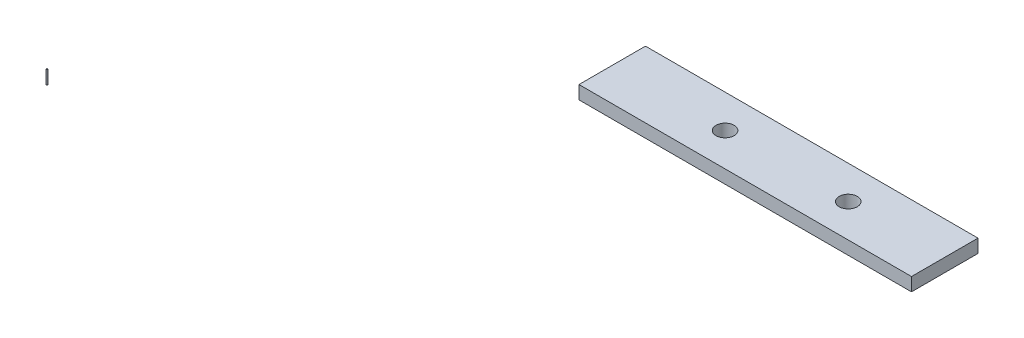
ISO-10303-21;
HEADER;
FILE_DESCRIPTION(('STEP AP214'),'2;1');
FILE_NAME('part.step','',(''),(''),'','','');
FILE_SCHEMA(('AUTOMOTIVE_DESIGN { 1 0 10303 214 1 1 1 1 }'));
ENDSEC;
DATA;
#1=APPLICATION_CONTEXT('core data for automotive mechanical design processes');
#2=APPLICATION_PROTOCOL_DEFINITION('international standard','automotive_design',2000,#1);
#3=PRODUCT_CONTEXT('',#1,'mechanical');
#4=PRODUCT('Part','Part','',(#3));
#5=PRODUCT_RELATED_PRODUCT_CATEGORY('part','',(#4));
#6=PRODUCT_DEFINITION_FORMATION('','',#4);
#7=PRODUCT_DEFINITION_CONTEXT('part definition',#1,'design');
#8=PRODUCT_DEFINITION('design','',#6,#7);
#9=PRODUCT_DEFINITION_SHAPE('','',#8);
#10=(LENGTH_UNIT() NAMED_UNIT(*) SI_UNIT(.MILLI.,.METRE.));
#11=(NAMED_UNIT(*) PLANE_ANGLE_UNIT() SI_UNIT($,.RADIAN.));
#12=(NAMED_UNIT(*) SI_UNIT($,.STERADIAN.) SOLID_ANGLE_UNIT());
#13=UNCERTAINTY_MEASURE_WITH_UNIT(LENGTH_MEASURE(1.E-05),#10,'distance_accuracy_value','');
#14=(GEOMETRIC_REPRESENTATION_CONTEXT(3) GLOBAL_UNCERTAINTY_ASSIGNED_CONTEXT((#13)) GLOBAL_UNIT_ASSIGNED_CONTEXT((#10,
#11,#12)) REPRESENTATION_CONTEXT('',''));
#15=CARTESIAN_POINT('',(0.,0.,0.));
#16=DIRECTION('',(0.,0.,1.));
#17=DIRECTION('',(1.,0.,0.));
#18=AXIS2_PLACEMENT_3D('',#15,#16,#17);
#19=CARTESIAN_POINT('',(-50.8,5.08,27.94));
#20=DIRECTION('',(0.,-1.,0.));
#21=DIRECTION('',(0.,0.,-1.));
#22=AXIS2_PLACEMENT_3D('',#19,#20,#21);
#23=CYLINDRICAL_SURFACE('',#22,0.127000000000001);
#24=CARTESIAN_POINT('',(-50.8,5.08,27.94));
#25=DIRECTION('',(0.,1.,0.));
#26=DIRECTION('',(0.,0.,1.));
#27=AXIS2_PLACEMENT_3D('',#24,#25,#26);
#28=CIRCLE('',#27,0.127000000000001);
#29=CARTESIAN_POINT('',(-50.8,5.08,28.067));
#30=VERTEX_POINT('',#29);
#31=EDGE_CURVE('E12',#30,#30,#28,.T.);
#32=ORIENTED_EDGE('',*,*,#31,.F.);
#33=EDGE_LOOP('',(#32));
#34=FACE_BOUND('',#33,.T.);
#35=CARTESIAN_POINT('',(-50.8,2.54,27.94));
#36=DIRECTION('',(0.,1.,0.));
#37=DIRECTION('',(0.,0.,1.));
#38=AXIS2_PLACEMENT_3D('',#35,#36,#37);
#39=CIRCLE('',#38,0.127000000000001);
#40=CARTESIAN_POINT('',(-50.8,2.54,28.067));
#41=VERTEX_POINT('',#40);
#42=EDGE_CURVE('E47',#41,#41,#39,.T.);
#43=ORIENTED_EDGE('',*,*,#42,.T.);
#44=EDGE_LOOP('',(#43));
#45=FACE_BOUND('',#44,.T.);
#46=ADVANCED_FACE('F44',(#34,#45),#23,.T.);
#47=CARTESIAN_POINT('',(-50.8,5.08,27.94));
#48=DIRECTION('',(0.,1.,0.));
#49=DIRECTION('',(0.,0.,1.));
#50=AXIS2_PLACEMENT_3D('',#47,#48,#49);
#51=PLANE('',#50);
#52=ORIENTED_EDGE('',*,*,#31,.T.);
#53=EDGE_LOOP('',(#52));
#54=FACE_BOUND('',#53,.T.);
#55=ADVANCED_FACE('F59',(#54),#51,.T.);
#56=CARTESIAN_POINT('',(-50.8,2.54,27.94));
#57=DIRECTION('',(0.,1.,0.));
#58=DIRECTION('',(0.,0.,1.));
#59=AXIS2_PLACEMENT_3D('',#56,#57,#58);
#60=PLANE('',#59);
#61=ORIENTED_EDGE('',*,*,#42,.F.);
#62=EDGE_LOOP('',(#61));
#63=FACE_BOUND('',#62,.T.);
#64=ADVANCED_FACE('F57',(#63),#60,.F.);
#65=CLOSED_SHELL('',(#46,#55,#64));
#66=MANIFOLD_SOLID_BREP('B2',#65);
#67=CARTESIAN_POINT('',(0.,2.54,0.));
#68=DIRECTION('',(1.,0.,0.));
#69=DIRECTION('',(0.,0.,-1.));
#70=AXIS2_PLACEMENT_3D('',#67,#68,#69);
#71=PLANE('',#70);
#72=DIRECTION('',(0.,1.,0.));
#73=VECTOR('',#72,1.);
#74=CARTESIAN_POINT('',(0.,0.,-35.56));
#75=LINE('',#74,#73);
#76=CARTESIAN_POINT('',(0.,0.,-35.56));
#77=VERTEX_POINT('',#76);
#78=CARTESIAN_POINT('',(0.,2.54,-35.56));
#79=VERTEX_POINT('',#78);
#80=EDGE_CURVE('E129',#77,#79,#75,.T.);
#81=ORIENTED_EDGE('',*,*,#80,.F.);
#82=DIRECTION('',(0.,0.,1.));
#83=VECTOR('',#82,1.);
#84=CARTESIAN_POINT('',(0.,0.,0.));
#85=LINE('',#84,#83);
#86=CARTESIAN_POINT('',(0.,0.,-22.86));
#87=VERTEX_POINT('',#86);
#88=EDGE_CURVE('E84',#77,#87,#85,.T.);
#89=ORIENTED_EDGE('',*,*,#88,.T.);
#90=DIRECTION('',(0.,1.,0.));
#91=VECTOR('',#90,1.);
#92=CARTESIAN_POINT('',(0.,0.,-22.86));
#93=LINE('',#92,#91);
#94=CARTESIAN_POINT('',(0.,2.54,-22.86));
#95=VERTEX_POINT('',#94);
#96=EDGE_CURVE('E95',#87,#95,#93,.T.);
#97=ORIENTED_EDGE('',*,*,#96,.T.);
#98=DIRECTION('',(0.,0.,1.));
#99=VECTOR('',#98,1.);
#100=CARTESIAN_POINT('',(0.,2.54,0.));
#101=LINE('',#100,#99);
#102=EDGE_CURVE('E42',#79,#95,#101,.T.);
#103=ORIENTED_EDGE('',*,*,#102,.F.);
#104=EDGE_LOOP('',(#81,#89,#97,#103));
#105=FACE_BOUND('',#104,.T.);
#106=ADVANCED_FACE('F81',(#105),#71,.F.);
#107=CARTESIAN_POINT('',(0.,2.54,-58.42));
#108=DIRECTION('',(0.,-1.,0.));
#109=DIRECTION('',(0.,0.,-1.));
#110=AXIS2_PLACEMENT_3D('',#107,#108,#109);
#111=PLANE('',#110);
#112=CARTESIAN_POINT('',(21.55,2.54,-29.21));
#113=DIRECTION('',(0.,1.,0.));
#114=DIRECTION('',(0.,0.,1.));
#115=AXIS2_PLACEMENT_3D('',#112,#113,#114);
#116=CIRCLE('',#115,1.7272);
#117=CARTESIAN_POINT('',(21.55,2.54,-27.4828));
#118=VERTEX_POINT('',#117);
#119=EDGE_CURVE('E191',#118,#118,#116,.T.);
#120=ORIENTED_EDGE('',*,*,#119,.F.);
#121=EDGE_LOOP('',(#120));
#122=FACE_BOUND('',#121,.T.);
#123=CARTESIAN_POINT('',(45.065,2.54,-29.21));
#124=DIRECTION('',(0.,1.,0.));
#125=DIRECTION('',(0.,0.,1.));
#126=AXIS2_PLACEMENT_3D('',#123,#124,#125);
#127=CIRCLE('',#126,1.7272);
#128=CARTESIAN_POINT('',(45.065,2.54,-27.4828));
#129=VERTEX_POINT('',#128);
#130=EDGE_CURVE('E193',#129,#129,#127,.T.);
#131=ORIENTED_EDGE('',*,*,#130,.F.);
#132=EDGE_LOOP('',(#131));
#133=FACE_BOUND('',#132,.T.);
#134=DIRECTION('',(-1.,0.,0.));
#135=VECTOR('',#134,1.);
#136=CARTESIAN_POINT('',(0.,2.54,-35.56));
#137=LINE('',#136,#135);
#138=CARTESIAN_POINT('',(63.5,2.54,-35.56));
#139=VERTEX_POINT('',#138);
#140=EDGE_CURVE('E127',#139,#79,#137,.T.);
#141=ORIENTED_EDGE('',*,*,#140,.T.);
#142=ORIENTED_EDGE('',*,*,#102,.T.);
#143=DIRECTION('',(1.,0.,0.));
#144=VECTOR('',#143,1.);
#145=CARTESIAN_POINT('',(63.5,2.54,-22.86));
#146=LINE('',#145,#144);
#147=CARTESIAN_POINT('',(63.5,2.54,-22.86));
#148=VERTEX_POINT('',#147);
#149=EDGE_CURVE('E144',#95,#148,#146,.T.);
#150=ORIENTED_EDGE('',*,*,#149,.T.);
#151=DIRECTION('',(0.,0.,-1.));
#152=VECTOR('',#151,1.);
#153=CARTESIAN_POINT('',(63.5,2.54,-35.56));
#154=LINE('',#153,#152);
#155=EDGE_CURVE('E147',#148,#139,#154,.T.);
#156=ORIENTED_EDGE('',*,*,#155,.T.);
#157=EDGE_LOOP('',(#141,#142,#150,#156));
#158=FACE_BOUND('',#157,.T.);
#159=ADVANCED_FACE('F154',(#122,#133,#158),#111,.F.);
#160=CARTESIAN_POINT('',(0.,0.,-58.42));
#161=DIRECTION('',(0.,-1.,0.));
#162=DIRECTION('',(0.,0.,-1.));
#163=AXIS2_PLACEMENT_3D('',#160,#161,#162);
#164=PLANE('',#163);
#165=CARTESIAN_POINT('',(21.55,0.,-29.21));
#166=DIRECTION('',(0.,1.,0.));
#167=DIRECTION('',(0.,0.,1.));
#168=AXIS2_PLACEMENT_3D('',#165,#166,#167);
#169=CIRCLE('',#168,1.7272);
#170=CARTESIAN_POINT('',(21.55,0.,-27.4828));
#171=VERTEX_POINT('',#170);
#172=EDGE_CURVE('E189',#171,#171,#169,.T.);
#173=ORIENTED_EDGE('',*,*,#172,.T.);
#174=EDGE_LOOP('',(#173));
#175=FACE_BOUND('',#174,.T.);
#176=CARTESIAN_POINT('',(45.065,0.,-29.21));
#177=DIRECTION('',(0.,1.,0.));
#178=DIRECTION('',(0.,0.,1.));
#179=AXIS2_PLACEMENT_3D('',#176,#177,#178);
#180=CIRCLE('',#179,1.7272);
#181=CARTESIAN_POINT('',(45.065,0.,-27.4828));
#182=VERTEX_POINT('',#181);
#183=EDGE_CURVE('E148',#182,#182,#180,.T.);
#184=ORIENTED_EDGE('',*,*,#183,.T.);
#185=EDGE_LOOP('',(#184));
#186=FACE_BOUND('',#185,.T.);
#187=ORIENTED_EDGE('',*,*,#88,.F.);
#188=DIRECTION('',(-1.,0.,0.));
#189=VECTOR('',#188,1.);
#190=CARTESIAN_POINT('',(0.,0.,-35.56));
#191=LINE('',#190,#189);
#192=CARTESIAN_POINT('',(63.5,0.,-35.56));
#193=VERTEX_POINT('',#192);
#194=EDGE_CURVE('E124',#193,#77,#191,.T.);
#195=ORIENTED_EDGE('',*,*,#194,.F.);
#196=DIRECTION('',(0.,0.,-1.));
#197=VECTOR('',#196,1.);
#198=CARTESIAN_POINT('',(63.5,0.,-35.56));
#199=LINE('',#198,#197);
#200=CARTESIAN_POINT('',(63.5,0.,-22.86));
#201=VERTEX_POINT('',#200);
#202=EDGE_CURVE('E132',#201,#193,#199,.T.);
#203=ORIENTED_EDGE('',*,*,#202,.F.);
#204=DIRECTION('',(1.,0.,0.));
#205=VECTOR('',#204,1.);
#206=CARTESIAN_POINT('',(63.5,0.,-22.86));
#207=LINE('',#206,#205);
#208=EDGE_CURVE('E135',#87,#201,#207,.T.);
#209=ORIENTED_EDGE('',*,*,#208,.F.);
#210=EDGE_LOOP('',(#187,#195,#203,#209));
#211=FACE_BOUND('',#210,.T.);
#212=ADVANCED_FACE('F138',(#175,#186,#211),#164,.T.);
#213=CARTESIAN_POINT('',(0.,0.,-35.56));
#214=DIRECTION('',(0.,0.,-1.));
#215=DIRECTION('',(-1.,0.,0.));
#216=AXIS2_PLACEMENT_3D('',#213,#214,#215);
#217=PLANE('',#216);
#218=ORIENTED_EDGE('',*,*,#140,.F.);
#219=DIRECTION('',(0.,1.,0.));
#220=VECTOR('',#219,1.);
#221=CARTESIAN_POINT('',(63.5,0.,-35.56));
#222=LINE('',#221,#220);
#223=EDGE_CURVE('E121',#193,#139,#222,.T.);
#224=ORIENTED_EDGE('',*,*,#223,.F.);
#225=ORIENTED_EDGE('',*,*,#194,.T.);
#226=ORIENTED_EDGE('',*,*,#80,.T.);
#227=EDGE_LOOP('',(#218,#224,#225,#226));
#228=FACE_BOUND('',#227,.T.);
#229=ADVANCED_FACE('F122',(#228),#217,.T.);
#230=CARTESIAN_POINT('',(63.5,0.,-35.56));
#231=DIRECTION('',(1.,0.,0.));
#232=DIRECTION('',(0.,0.,-1.));
#233=AXIS2_PLACEMENT_3D('',#230,#231,#232);
#234=PLANE('',#233);
#235=ORIENTED_EDGE('',*,*,#155,.F.);
#236=DIRECTION('',(0.,1.,0.));
#237=VECTOR('',#236,1.);
#238=CARTESIAN_POINT('',(63.5,0.,-22.86));
#239=LINE('',#238,#237);
#240=EDGE_CURVE('E103',#201,#148,#239,.T.);
#241=ORIENTED_EDGE('',*,*,#240,.F.);
#242=ORIENTED_EDGE('',*,*,#202,.T.);
#243=ORIENTED_EDGE('',*,*,#223,.T.);
#244=EDGE_LOOP('',(#235,#241,#242,#243));
#245=FACE_BOUND('',#244,.T.);
#246=ADVANCED_FACE('F133',(#245),#234,.T.);
#247=CARTESIAN_POINT('',(63.5,0.,-22.86));
#248=DIRECTION('',(0.,0.,1.));
#249=DIRECTION('',(1.,0.,0.));
#250=AXIS2_PLACEMENT_3D('',#247,#248,#249);
#251=PLANE('',#250);
#252=ORIENTED_EDGE('',*,*,#149,.F.);
#253=ORIENTED_EDGE('',*,*,#96,.F.);
#254=ORIENTED_EDGE('',*,*,#208,.T.);
#255=ORIENTED_EDGE('',*,*,#240,.T.);
#256=EDGE_LOOP('',(#252,#253,#254,#255));
#257=FACE_BOUND('',#256,.T.);
#258=ADVANCED_FACE('F152',(#257),#251,.T.);
#259=CARTESIAN_POINT('',(45.065,0.,-29.21));
#260=DIRECTION('',(0.,1.,0.));
#261=DIRECTION('',(0.,0.,1.));
#262=AXIS2_PLACEMENT_3D('',#259,#260,#261);
#263=CYLINDRICAL_SURFACE('',#262,1.7272);
#264=ORIENTED_EDGE('',*,*,#183,.F.);
#265=EDGE_LOOP('',(#264));
#266=FACE_BOUND('',#265,.T.);
#267=ORIENTED_EDGE('',*,*,#130,.T.);
#268=EDGE_LOOP('',(#267));
#269=FACE_BOUND('',#268,.T.);
#270=ADVANCED_FACE('F174',(#266,#269),#263,.F.);
#271=CARTESIAN_POINT('',(21.55,0.,-29.21));
#272=DIRECTION('',(0.,1.,0.));
#273=DIRECTION('',(0.,0.,1.));
#274=AXIS2_PLACEMENT_3D('',#271,#272,#273);
#275=CYLINDRICAL_SURFACE('',#274,1.7272);
#276=ORIENTED_EDGE('',*,*,#172,.F.);
#277=EDGE_LOOP('',(#276));
#278=FACE_BOUND('',#277,.T.);
#279=ORIENTED_EDGE('',*,*,#119,.T.);
#280=EDGE_LOOP('',(#279));
#281=FACE_BOUND('',#280,.T.);
#282=ADVANCED_FACE('F180',(#278,#281),#275,.F.);
#283=CLOSED_SHELL('',(#106,#159,#212,#229,#246,#258,#270,#282));
#284=MANIFOLD_SOLID_BREP('B7',#283);
#285=ADVANCED_BREP_SHAPE_REPRESENTATION('',(#18,#66,#284),#14);
#286=SHAPE_DEFINITION_REPRESENTATION(#9,#285);
ENDSEC;
END-ISO-10303-21;
